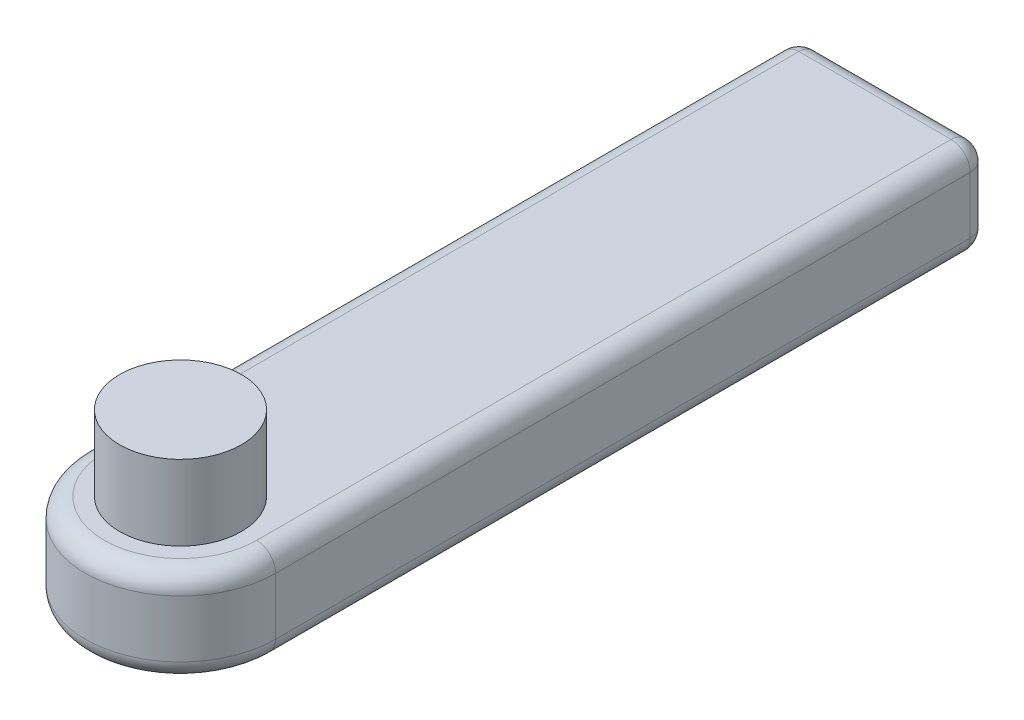
ISO-10303-21;
HEADER;
FILE_DESCRIPTION(('STEP AP214'),'2;1');
FILE_NAME('part.step','',(''),(''),'','','');
FILE_SCHEMA(('AUTOMOTIVE_DESIGN { 1 0 10303 214 1 1 1 1 }'));
ENDSEC;
DATA;
#1=APPLICATION_CONTEXT('core data for automotive mechanical design processes');
#2=APPLICATION_PROTOCOL_DEFINITION('international standard','automotive_design',2000,#1);
#3=PRODUCT_CONTEXT('',#1,'mechanical');
#4=PRODUCT('Part','Part','',(#3));
#5=PRODUCT_RELATED_PRODUCT_CATEGORY('part','',(#4));
#6=PRODUCT_DEFINITION_FORMATION('','',#4);
#7=PRODUCT_DEFINITION_CONTEXT('part definition',#1,'design');
#8=PRODUCT_DEFINITION('design','',#6,#7);
#9=PRODUCT_DEFINITION_SHAPE('','',#8);
#10=(LENGTH_UNIT() NAMED_UNIT(*) SI_UNIT(.MILLI.,.METRE.));
#11=(NAMED_UNIT(*) PLANE_ANGLE_UNIT() SI_UNIT($,.RADIAN.));
#12=(NAMED_UNIT(*) SI_UNIT($,.STERADIAN.) SOLID_ANGLE_UNIT());
#13=UNCERTAINTY_MEASURE_WITH_UNIT(LENGTH_MEASURE(1.E-05),#10,'distance_accuracy_value','');
#14=(GEOMETRIC_REPRESENTATION_CONTEXT(3) GLOBAL_UNCERTAINTY_ASSIGNED_CONTEXT((#13)) GLOBAL_UNIT_ASSIGNED_CONTEXT((#10,
#11,#12)) REPRESENTATION_CONTEXT('',''));
#15=CARTESIAN_POINT('',(0.,0.,0.));
#16=DIRECTION('',(0.,0.,1.));
#17=DIRECTION('',(1.,0.,0.));
#18=AXIS2_PLACEMENT_3D('',#15,#16,#17);
#19=CARTESIAN_POINT('',(0.,10.,0.));
#20=DIRECTION('',(0.,-1.,0.));
#21=DIRECTION('',(0.,0.,-1.));
#22=AXIS2_PLACEMENT_3D('',#19,#20,#21);
#23=CYLINDRICAL_SURFACE('',#22,10.);
#24=DIRECTION('',(0.,-1.,0.));
#25=VECTOR('',#24,1.);
#26=CARTESIAN_POINT('',(10.,10.,0.));
#27=LINE('',#26,#25);
#28=CARTESIAN_POINT('',(10.,8.,0.));
#29=VERTEX_POINT('',#28);
#30=CARTESIAN_POINT('',(10.,2.,0.));
#31=VERTEX_POINT('',#30);
#32=EDGE_CURVE('E146',#29,#31,#27,.T.);
#33=ORIENTED_EDGE('',*,*,#32,.F.);
#34=CARTESIAN_POINT('',(0.,8.,0.));
#35=DIRECTION('',(0.,1.,0.));
#36=DIRECTION('',(0.,0.,1.));
#37=AXIS2_PLACEMENT_3D('',#34,#35,#36);
#38=CIRCLE('',#37,10.);
#39=CARTESIAN_POINT('',(-10.,8.,0.));
#40=VERTEX_POINT('',#39);
#41=EDGE_CURVE('E178',#29,#40,#38,.F.);
#42=ORIENTED_EDGE('',*,*,#41,.T.);
#43=DIRECTION('',(0.,-1.,0.));
#44=VECTOR('',#43,1.);
#45=CARTESIAN_POINT('',(-10.,10.,0.));
#46=LINE('',#45,#44);
#47=CARTESIAN_POINT('',(-10.,2.,0.));
#48=VERTEX_POINT('',#47);
#49=EDGE_CURVE('E237',#40,#48,#46,.T.);
#50=ORIENTED_EDGE('',*,*,#49,.T.);
#51=CARTESIAN_POINT('',(0.,2.,0.));
#52=DIRECTION('',(0.,1.,0.));
#53=DIRECTION('',(0.,0.,1.));
#54=AXIS2_PLACEMENT_3D('',#51,#52,#53);
#55=CIRCLE('',#54,10.);
#56=EDGE_CURVE('E176',#48,#31,#55,.T.);
#57=ORIENTED_EDGE('',*,*,#56,.T.);
#58=EDGE_LOOP('',(#33,#42,#50,#57));
#59=FACE_BOUND('',#58,.T.);
#60=ADVANCED_FACE('F44',(#59),#23,.T.);
#61=CARTESIAN_POINT('',(10.,10.,0.));
#62=DIRECTION('',(-1.,0.,0.));
#63=DIRECTION('',(0.,0.,1.));
#64=AXIS2_PLACEMENT_3D('',#61,#62,#63);
#65=PLANE('',#64);
#66=ORIENTED_EDGE('',*,*,#32,.T.);
#67=DIRECTION('',(0.,0.,-1.));
#68=VECTOR('',#67,1.);
#69=CARTESIAN_POINT('',(10.,2.,0.));
#70=LINE('',#69,#68);
#71=CARTESIAN_POINT('',(10.,2.,-73.));
#72=VERTEX_POINT('',#71);
#73=EDGE_CURVE('E165',#31,#72,#70,.T.);
#74=ORIENTED_EDGE('',*,*,#73,.T.);
#75=DIRECTION('',(0.,-1.,0.));
#76=VECTOR('',#75,1.);
#77=CARTESIAN_POINT('',(10.,10.,-73.));
#78=LINE('',#77,#76);
#79=CARTESIAN_POINT('',(10.,8.,-73.));
#80=VERTEX_POINT('',#79);
#81=EDGE_CURVE('E161',#72,#80,#78,.F.);
#82=ORIENTED_EDGE('',*,*,#81,.T.);
#83=DIRECTION('',(0.,0.,-1.));
#84=VECTOR('',#83,1.);
#85=CARTESIAN_POINT('',(10.,8.,0.));
#86=LINE('',#85,#84);
#87=EDGE_CURVE('E163',#80,#29,#86,.F.);
#88=ORIENTED_EDGE('',*,*,#87,.T.);
#89=EDGE_LOOP('',(#66,#74,#82,#88));
#90=FACE_BOUND('',#89,.T.);
#91=ADVANCED_FACE('F246',(#90),#65,.F.);
#92=CARTESIAN_POINT('',(0.,10.,-75.));
#93=DIRECTION('',(0.,0.,-1.));
#94=DIRECTION('',(-1.,0.,0.));
#95=AXIS2_PLACEMENT_3D('',#92,#93,#94);
#96=PLANE('',#95);
#97=DIRECTION('',(1.,0.,0.));
#98=VECTOR('',#97,1.);
#99=CARTESIAN_POINT('',(0.,8.,-75.));
#100=LINE('',#99,#98);
#101=CARTESIAN_POINT('',(-8.,8.,-75.));
#102=VERTEX_POINT('',#101);
#103=CARTESIAN_POINT('',(8.,8.,-75.));
#104=VERTEX_POINT('',#103);
#105=EDGE_CURVE('E180',#102,#104,#100,.T.);
#106=ORIENTED_EDGE('',*,*,#105,.T.);
#107=DIRECTION('',(0.,-1.,0.));
#108=VECTOR('',#107,1.);
#109=CARTESIAN_POINT('',(8.,0.,-75.));
#110=LINE('',#109,#108);
#111=CARTESIAN_POINT('',(8.,2.,-75.));
#112=VERTEX_POINT('',#111);
#113=EDGE_CURVE('E11',#104,#112,#110,.T.);
#114=ORIENTED_EDGE('',*,*,#113,.T.);
#115=DIRECTION('',(1.,0.,0.));
#116=VECTOR('',#115,1.);
#117=CARTESIAN_POINT('',(-10.,2.,-75.));
#118=LINE('',#117,#116);
#119=CARTESIAN_POINT('',(-8.,2.,-75.));
#120=VERTEX_POINT('',#119);
#121=EDGE_CURVE('E53',#112,#120,#118,.F.);
#122=ORIENTED_EDGE('',*,*,#121,.T.);
#123=DIRECTION('',(0.,-1.,0.));
#124=VECTOR('',#123,1.);
#125=CARTESIAN_POINT('',(-8.,10.,-75.));
#126=LINE('',#125,#124);
#127=EDGE_CURVE('E182',#120,#102,#126,.F.);
#128=ORIENTED_EDGE('',*,*,#127,.T.);
#129=EDGE_LOOP('',(#106,#114,#122,#128));
#130=FACE_BOUND('',#129,.T.);
#131=CARTESIAN_POINT('',(0.,5.,-75.));
#132=DIRECTION('',(0.,0.,-1.));
#133=DIRECTION('',(-1.,0.,0.));
#134=AXIS2_PLACEMENT_3D('',#131,#132,#133);
#135=CIRCLE('',#134,2.75);
#136=CARTESIAN_POINT('',(-2.75,5.,-75.));
#137=VERTEX_POINT('',#136);
#138=EDGE_CURVE('E220',#137,#137,#135,.T.);
#139=ORIENTED_EDGE('',*,*,#138,.F.);
#140=EDGE_LOOP('',(#139));
#141=FACE_BOUND('',#140,.T.);
#142=ADVANCED_FACE('F275',(#130,#141),#96,.T.);
#143=CARTESIAN_POINT('',(-10.,10.,0.));
#144=DIRECTION('',(-1.,0.,0.));
#145=DIRECTION('',(0.,0.,1.));
#146=AXIS2_PLACEMENT_3D('',#143,#144,#145);
#147=PLANE('',#146);
#148=DIRECTION('',(0.,-1.,0.));
#149=VECTOR('',#148,1.);
#150=CARTESIAN_POINT('',(-10.,10.,-73.));
#151=LINE('',#150,#149);
#152=CARTESIAN_POINT('',(-10.,8.,-73.));
#153=VERTEX_POINT('',#152);
#154=CARTESIAN_POINT('',(-10.,2.,-73.));
#155=VERTEX_POINT('',#154);
#156=EDGE_CURVE('E158',#153,#155,#151,.T.);
#157=ORIENTED_EDGE('',*,*,#156,.T.);
#158=DIRECTION('',(0.,0.,-1.));
#159=VECTOR('',#158,1.);
#160=CARTESIAN_POINT('',(-10.,2.,0.));
#161=LINE('',#160,#159);
#162=EDGE_CURVE('E128',#155,#48,#161,.F.);
#163=ORIENTED_EDGE('',*,*,#162,.T.);
#164=ORIENTED_EDGE('',*,*,#49,.F.);
#165=DIRECTION('',(0.,0.,-1.));
#166=VECTOR('',#165,1.);
#167=CARTESIAN_POINT('',(-10.,8.,0.));
#168=LINE('',#167,#166);
#169=EDGE_CURVE('E153',#40,#153,#168,.T.);
#170=ORIENTED_EDGE('',*,*,#169,.T.);
#171=EDGE_LOOP('',(#157,#163,#164,#170));
#172=FACE_BOUND('',#171,.T.);
#173=ADVANCED_FACE('F259',(#172),#147,.T.);
#174=CARTESIAN_POINT('',(0.,10.,0.));
#175=DIRECTION('',(0.,1.,0.));
#176=DIRECTION('',(0.,0.,1.));
#177=AXIS2_PLACEMENT_3D('',#174,#175,#176);
#178=PLANE('',#177);
#179=CARTESIAN_POINT('',(0.,10.,0.));
#180=DIRECTION('',(0.,1.,0.));
#181=DIRECTION('',(0.,0.,1.));
#182=AXIS2_PLACEMENT_3D('',#179,#180,#181);
#183=CIRCLE('',#182,8.);
#184=CARTESIAN_POINT('',(-8.,10.,0.));
#185=VERTEX_POINT('',#184);
#186=CARTESIAN_POINT('',(8.,10.,0.));
#187=VERTEX_POINT('',#186);
#188=EDGE_CURVE('E171',#185,#187,#183,.T.);
#189=ORIENTED_EDGE('',*,*,#188,.T.);
#190=DIRECTION('',(0.,0.,-1.));
#191=VECTOR('',#190,1.);
#192=CARTESIAN_POINT('',(8.,10.,-75.));
#193=LINE('',#192,#191);
#194=CARTESIAN_POINT('',(8.,10.,-73.));
#195=VERTEX_POINT('',#194);
#196=EDGE_CURVE('E173',#187,#195,#193,.T.);
#197=ORIENTED_EDGE('',*,*,#196,.T.);
#198=DIRECTION('',(1.,0.,0.));
#199=VECTOR('',#198,1.);
#200=CARTESIAN_POINT('',(0.,10.,-73.));
#201=LINE('',#200,#199);
#202=CARTESIAN_POINT('',(-8.,10.,-73.));
#203=VERTEX_POINT('',#202);
#204=EDGE_CURVE('E169',#195,#203,#201,.F.);
#205=ORIENTED_EDGE('',*,*,#204,.T.);
#206=DIRECTION('',(0.,0.,-1.));
#207=VECTOR('',#206,1.);
#208=CARTESIAN_POINT('',(-8.,10.,0.));
#209=LINE('',#208,#207);
#210=EDGE_CURVE('E167',#203,#185,#209,.F.);
#211=ORIENTED_EDGE('',*,*,#210,.T.);
#212=EDGE_LOOP('',(#189,#197,#205,#211));
#213=FACE_BOUND('',#212,.T.);
#214=CARTESIAN_POINT('',(0.,10.,0.));
#215=DIRECTION('',(0.,1.,0.));
#216=DIRECTION('',(0.,0.,1.));
#217=AXIS2_PLACEMENT_3D('',#214,#215,#216);
#218=CIRCLE('',#217,6.4);
#219=CARTESIAN_POINT('',(0.,10.,6.4));
#220=VERTEX_POINT('',#219);
#221=EDGE_CURVE('E231',#220,#220,#218,.T.);
#222=ORIENTED_EDGE('',*,*,#221,.F.);
#223=EDGE_LOOP('',(#222));
#224=FACE_BOUND('',#223,.T.);
#225=ADVANCED_FACE('F440',(#213,#224),#178,.T.);
#226=CARTESIAN_POINT('',(0.,0.,0.));
#227=DIRECTION('',(0.,1.,0.));
#228=DIRECTION('',(0.,0.,1.));
#229=AXIS2_PLACEMENT_3D('',#226,#227,#228);
#230=PLANE('',#229);
#231=DIRECTION('',(0.,0.,-1.));
#232=VECTOR('',#231,1.);
#233=CARTESIAN_POINT('',(8.,0.,0.));
#234=LINE('',#233,#232);
#235=CARTESIAN_POINT('',(8.,0.,-73.));
#236=VERTEX_POINT('',#235);
#237=CARTESIAN_POINT('',(8.,0.,0.));
#238=VERTEX_POINT('',#237);
#239=EDGE_CURVE('E145',#236,#238,#234,.F.);
#240=ORIENTED_EDGE('',*,*,#239,.T.);
#241=CARTESIAN_POINT('',(0.,0.,0.));
#242=DIRECTION('',(0.,1.,0.));
#243=DIRECTION('',(0.,0.,1.));
#244=AXIS2_PLACEMENT_3D('',#241,#242,#243);
#245=CIRCLE('',#244,8.);
#246=CARTESIAN_POINT('',(-8.,0.,0.));
#247=VERTEX_POINT('',#246);
#248=EDGE_CURVE('E150',#238,#247,#245,.F.);
#249=ORIENTED_EDGE('',*,*,#248,.T.);
#250=DIRECTION('',(0.,0.,-1.));
#251=VECTOR('',#250,1.);
#252=CARTESIAN_POINT('',(-8.,0.,-75.));
#253=LINE('',#252,#251);
#254=CARTESIAN_POINT('',(-8.,0.,-73.));
#255=VERTEX_POINT('',#254);
#256=EDGE_CURVE('E126',#247,#255,#253,.T.);
#257=ORIENTED_EDGE('',*,*,#256,.T.);
#258=DIRECTION('',(1.,0.,0.));
#259=VECTOR('',#258,1.);
#260=CARTESIAN_POINT('',(10.,0.,-73.));
#261=LINE('',#260,#259);
#262=EDGE_CURVE('E140',#255,#236,#261,.T.);
#263=ORIENTED_EDGE('',*,*,#262,.T.);
#264=EDGE_LOOP('',(#240,#249,#257,#263));
#265=FACE_BOUND('',#264,.T.);
#266=ADVANCED_FACE('F148',(#265),#230,.F.);
#267=CARTESIAN_POINT('',(0.,17.9,0.));
#268=DIRECTION('',(0.,-1.,0.));
#269=DIRECTION('',(0.,0.,-1.));
#270=AXIS2_PLACEMENT_3D('',#267,#268,#269);
#271=CYLINDRICAL_SURFACE('',#270,6.4);
#272=CARTESIAN_POINT('',(0.,17.9,0.));
#273=DIRECTION('',(0.,1.,0.));
#274=DIRECTION('',(0.,0.,1.));
#275=AXIS2_PLACEMENT_3D('',#272,#273,#274);
#276=CIRCLE('',#275,6.4);
#277=CARTESIAN_POINT('',(0.,17.9,6.4));
#278=VERTEX_POINT('',#277);
#279=EDGE_CURVE('E234',#278,#278,#276,.T.);
#280=ORIENTED_EDGE('',*,*,#279,.F.);
#281=EDGE_LOOP('',(#280));
#282=FACE_BOUND('',#281,.T.);
#283=ORIENTED_EDGE('',*,*,#221,.T.);
#284=EDGE_LOOP('',(#283));
#285=FACE_BOUND('',#284,.T.);
#286=ADVANCED_FACE('F422',(#282,#285),#271,.T.);
#287=CARTESIAN_POINT('',(0.,17.9,0.));
#288=DIRECTION('',(0.,1.,0.));
#289=DIRECTION('',(0.,0.,1.));
#290=AXIS2_PLACEMENT_3D('',#287,#288,#289);
#291=PLANE('',#290);
#292=ORIENTED_EDGE('',*,*,#279,.T.);
#293=EDGE_LOOP('',(#292));
#294=FACE_BOUND('',#293,.T.);
#295=ADVANCED_FACE('F413',(#294),#291,.T.);
#296=CARTESIAN_POINT('',(0.,5.,-70.));
#297=DIRECTION('',(0.,0.,-1.));
#298=DIRECTION('',(-1.,0.,0.));
#299=AXIS2_PLACEMENT_3D('',#296,#297,#298);
#300=CYLINDRICAL_SURFACE('',#299,2.75);
#301=CARTESIAN_POINT('',(0.,5.,-70.));
#302=DIRECTION('',(0.,0.,-1.));
#303=DIRECTION('',(-1.,0.,0.));
#304=AXIS2_PLACEMENT_3D('',#301,#302,#303);
#305=CIRCLE('',#304,2.75);
#306=CARTESIAN_POINT('',(-2.75,5.,-70.));
#307=VERTEX_POINT('',#306);
#308=EDGE_CURVE('E226',#307,#307,#305,.T.);
#309=ORIENTED_EDGE('',*,*,#308,.F.);
#310=EDGE_LOOP('',(#309));
#311=FACE_BOUND('',#310,.T.);
#312=ORIENTED_EDGE('',*,*,#138,.T.);
#313=EDGE_LOOP('',(#312));
#314=FACE_BOUND('',#313,.T.);
#315=ADVANCED_FACE('F404',(#311,#314),#300,.F.);
#316=CARTESIAN_POINT('',(0.,5.,-70.));
#317=DIRECTION('',(0.,0.,-1.));
#318=DIRECTION('',(-1.,0.,0.));
#319=AXIS2_PLACEMENT_3D('',#316,#317,#318);
#320=PLANE('',#319);
#321=ORIENTED_EDGE('',*,*,#308,.T.);
#322=EDGE_LOOP('',(#321));
#323=FACE_BOUND('',#322,.T.);
#324=ADVANCED_FACE('F397',(#323),#320,.T.);
#325=CARTESIAN_POINT('',(8.,8.,0.));
#326=DIRECTION('',(0.,0.,1.));
#327=DIRECTION('',(1.,0.,0.));
#328=AXIS2_PLACEMENT_3D('',#325,#326,#327);
#329=CYLINDRICAL_SURFACE('',#328,2.);
#330=CARTESIAN_POINT('',(8.,8.,-73.));
#331=DIRECTION('',(0.,0.,-1.));
#332=DIRECTION('',(-1.,0.,0.));
#333=AXIS2_PLACEMENT_3D('',#330,#331,#332);
#334=CIRCLE('',#333,2.);
#335=EDGE_CURVE('E48',#195,#80,#334,.T.);
#336=ORIENTED_EDGE('',*,*,#335,.F.);
#337=ORIENTED_EDGE('',*,*,#196,.F.);
#338=CARTESIAN_POINT('',(8.,8.,0.));
#339=DIRECTION('',(0.,0.,1.));
#340=DIRECTION('',(1.,0.,0.));
#341=AXIS2_PLACEMENT_3D('',#338,#339,#340);
#342=CIRCLE('',#341,2.);
#343=EDGE_CURVE('E213',#29,#187,#342,.T.);
#344=ORIENTED_EDGE('',*,*,#343,.F.);
#345=ORIENTED_EDGE('',*,*,#87,.F.);
#346=EDGE_LOOP('',(#336,#337,#344,#345));
#347=FACE_BOUND('',#346,.T.);
#348=ADVANCED_FACE('F46',(#347),#329,.T.);
#349=CARTESIAN_POINT('',(8.,8.,-73.));
#350=DIRECTION('',(1.,0.,0.));
#351=DIRECTION('',(0.,0.,-1.));
#352=AXIS2_PLACEMENT_3D('',#349,#350,#351);
#353=SPHERICAL_SURFACE('',#352,2.);
#354=CARTESIAN_POINT('',(8.,8.,-73.));
#355=DIRECTION('',(1.,0.,0.));
#356=DIRECTION('',(0.,0.,-1.));
#357=AXIS2_PLACEMENT_3D('',#354,#355,#356);
#358=CIRCLE('',#357,2.);
#359=EDGE_CURVE('E208',#195,#104,#358,.F.);
#360=ORIENTED_EDGE('',*,*,#359,.F.);
#361=ORIENTED_EDGE('',*,*,#335,.T.);
#362=CARTESIAN_POINT('',(8.,8.,-73.));
#363=DIRECTION('',(0.,1.,0.));
#364=DIRECTION('',(0.,0.,1.));
#365=AXIS2_PLACEMENT_3D('',#362,#363,#364);
#366=CIRCLE('',#365,2.);
#367=EDGE_CURVE('E211',#104,#80,#366,.F.);
#368=ORIENTED_EDGE('',*,*,#367,.F.);
#369=EDGE_LOOP('',(#360,#361,#368));
#370=FACE_BOUND('',#369,.T.);
#371=ADVANCED_FACE('F280',(#370),#353,.T.);
#372=CARTESIAN_POINT('',(0.,8.,0.));
#373=DIRECTION('',(0.,1.,0.));
#374=DIRECTION('',(0.,0.,1.));
#375=AXIS2_PLACEMENT_3D('',#372,#373,#374);
#376=TOROIDAL_SURFACE('',#375,8.,2.);
#377=ORIENTED_EDGE('',*,*,#343,.T.);
#378=ORIENTED_EDGE('',*,*,#188,.F.);
#379=CARTESIAN_POINT('',(-8.,8.,0.));
#380=DIRECTION('',(0.,0.,-1.));
#381=DIRECTION('',(-1.,0.,0.));
#382=AXIS2_PLACEMENT_3D('',#379,#380,#381);
#383=CIRCLE('',#382,2.);
#384=EDGE_CURVE('E205',#40,#185,#383,.T.);
#385=ORIENTED_EDGE('',*,*,#384,.F.);
#386=ORIENTED_EDGE('',*,*,#41,.F.);
#387=EDGE_LOOP('',(#377,#378,#385,#386));
#388=FACE_BOUND('',#387,.T.);
#389=ADVANCED_FACE('F262',(#388),#376,.T.);
#390=CARTESIAN_POINT('',(8.,10.,-73.));
#391=DIRECTION('',(0.,1.,0.));
#392=DIRECTION('',(0.,0.,1.));
#393=AXIS2_PLACEMENT_3D('',#390,#391,#392);
#394=CYLINDRICAL_SURFACE('',#393,2.);
#395=ORIENTED_EDGE('',*,*,#367,.T.);
#396=ORIENTED_EDGE('',*,*,#81,.F.);
#397=CARTESIAN_POINT('',(8.,2.,-73.));
#398=DIRECTION('',(0.,-1.,0.));
#399=DIRECTION('',(0.,0.,-1.));
#400=AXIS2_PLACEMENT_3D('',#397,#398,#399);
#401=CIRCLE('',#400,2.);
#402=EDGE_CURVE('E202',#112,#72,#401,.T.);
#403=ORIENTED_EDGE('',*,*,#402,.F.);
#404=ORIENTED_EDGE('',*,*,#113,.F.);
#405=EDGE_LOOP('',(#395,#396,#403,#404));
#406=FACE_BOUND('',#405,.T.);
#407=ADVANCED_FACE('F283',(#406),#394,.T.);
#408=CARTESIAN_POINT('',(0.,8.,-73.));
#409=DIRECTION('',(1.,0.,0.));
#410=DIRECTION('',(0.,0.,-1.));
#411=AXIS2_PLACEMENT_3D('',#408,#409,#410);
#412=CYLINDRICAL_SURFACE('',#411,2.);
#413=ORIENTED_EDGE('',*,*,#359,.T.);
#414=ORIENTED_EDGE('',*,*,#105,.F.);
#415=CARTESIAN_POINT('',(-8.,8.,-73.));
#416=DIRECTION('',(-1.,0.,0.));
#417=DIRECTION('',(0.,0.,1.));
#418=AXIS2_PLACEMENT_3D('',#415,#416,#417);
#419=CIRCLE('',#418,2.);
#420=EDGE_CURVE('E199',#203,#102,#419,.T.);
#421=ORIENTED_EDGE('',*,*,#420,.F.);
#422=ORIENTED_EDGE('',*,*,#204,.F.);
#423=EDGE_LOOP('',(#413,#414,#421,#422));
#424=FACE_BOUND('',#423,.T.);
#425=ADVANCED_FACE('F278',(#424),#412,.T.);
#426=CARTESIAN_POINT('',(-8.,8.,0.));
#427=DIRECTION('',(0.,0.,-1.));
#428=DIRECTION('',(-1.,0.,0.));
#429=AXIS2_PLACEMENT_3D('',#426,#427,#428);
#430=CYLINDRICAL_SURFACE('',#429,2.);
#431=ORIENTED_EDGE('',*,*,#384,.T.);
#432=ORIENTED_EDGE('',*,*,#210,.F.);
#433=CARTESIAN_POINT('',(-8.,8.,-73.));
#434=DIRECTION('',(0.,0.,-1.));
#435=DIRECTION('',(-1.,0.,0.));
#436=AXIS2_PLACEMENT_3D('',#433,#434,#435);
#437=CIRCLE('',#436,2.);
#438=EDGE_CURVE('E196',#153,#203,#437,.T.);
#439=ORIENTED_EDGE('',*,*,#438,.F.);
#440=ORIENTED_EDGE('',*,*,#169,.F.);
#441=EDGE_LOOP('',(#431,#432,#439,#440));
#442=FACE_BOUND('',#441,.T.);
#443=ADVANCED_FACE('F267',(#442),#430,.T.);
#444=CARTESIAN_POINT('',(8.,2.,-73.));
#445=DIRECTION('',(1.,0.,0.));
#446=DIRECTION('',(0.,0.,-1.));
#447=AXIS2_PLACEMENT_3D('',#444,#445,#446);
#448=SPHERICAL_SURFACE('',#447,2.);
#449=CARTESIAN_POINT('',(8.,2.,-73.));
#450=DIRECTION('',(1.,0.,0.));
#451=DIRECTION('',(0.,0.,-1.));
#452=AXIS2_PLACEMENT_3D('',#449,#450,#451);
#453=CIRCLE('',#452,2.);
#454=EDGE_CURVE('E142',#112,#236,#453,.F.);
#455=ORIENTED_EDGE('',*,*,#454,.F.);
#456=ORIENTED_EDGE('',*,*,#402,.T.);
#457=CARTESIAN_POINT('',(8.,2.,-73.));
#458=DIRECTION('',(0.,0.,-1.));
#459=DIRECTION('',(-1.,0.,0.));
#460=AXIS2_PLACEMENT_3D('',#457,#458,#459);
#461=CIRCLE('',#460,2.);
#462=EDGE_CURVE('E193',#236,#72,#461,.F.);
#463=ORIENTED_EDGE('',*,*,#462,.F.);
#464=EDGE_LOOP('',(#455,#456,#463));
#465=FACE_BOUND('',#464,.T.);
#466=ADVANCED_FACE('F285',(#465),#448,.T.);
#467=CARTESIAN_POINT('',(-8.,8.,-73.));
#468=DIRECTION('',(0.,1.,0.));
#469=DIRECTION('',(0.,0.,1.));
#470=AXIS2_PLACEMENT_3D('',#467,#468,#469);
#471=SPHERICAL_SURFACE('',#470,2.);
#472=ORIENTED_EDGE('',*,*,#438,.T.);
#473=ORIENTED_EDGE('',*,*,#420,.T.);
#474=CARTESIAN_POINT('',(-8.,8.,-73.));
#475=DIRECTION('',(0.,1.,0.));
#476=DIRECTION('',(0.,0.,1.));
#477=AXIS2_PLACEMENT_3D('',#474,#475,#476);
#478=CIRCLE('',#477,2.);
#479=EDGE_CURVE('E189',#153,#102,#478,.F.);
#480=ORIENTED_EDGE('',*,*,#479,.F.);
#481=EDGE_LOOP('',(#472,#473,#480));
#482=FACE_BOUND('',#481,.T.);
#483=ADVANCED_FACE('F271',(#482),#471,.T.);
#484=CARTESIAN_POINT('',(8.,2.,0.));
#485=DIRECTION('',(0.,0.,-1.));
#486=DIRECTION('',(-1.,0.,0.));
#487=AXIS2_PLACEMENT_3D('',#484,#485,#486);
#488=CYLINDRICAL_SURFACE('',#487,2.);
#489=ORIENTED_EDGE('',*,*,#462,.T.);
#490=ORIENTED_EDGE('',*,*,#73,.F.);
#491=CARTESIAN_POINT('',(8.,2.,0.));
#492=DIRECTION('',(0.,0.,1.));
#493=DIRECTION('',(1.,0.,0.));
#494=AXIS2_PLACEMENT_3D('',#491,#492,#493);
#495=CIRCLE('',#494,2.);
#496=EDGE_CURVE('E138',#238,#31,#495,.T.);
#497=ORIENTED_EDGE('',*,*,#496,.F.);
#498=ORIENTED_EDGE('',*,*,#239,.F.);
#499=EDGE_LOOP('',(#489,#490,#497,#498));
#500=FACE_BOUND('',#499,.T.);
#501=ADVANCED_FACE('F252',(#500),#488,.T.);
#502=CARTESIAN_POINT('',(0.,2.,-73.));
#503=DIRECTION('',(-1.,0.,0.));
#504=DIRECTION('',(0.,0.,1.));
#505=AXIS2_PLACEMENT_3D('',#502,#503,#504);
#506=CYLINDRICAL_SURFACE('',#505,2.);
#507=ORIENTED_EDGE('',*,*,#454,.T.);
#508=ORIENTED_EDGE('',*,*,#262,.F.);
#509=CARTESIAN_POINT('',(-8.,2.,-73.));
#510=DIRECTION('',(-1.,0.,0.));
#511=DIRECTION('',(0.,0.,1.));
#512=AXIS2_PLACEMENT_3D('',#509,#510,#511);
#513=CIRCLE('',#512,2.);
#514=EDGE_CURVE('E133',#120,#255,#513,.T.);
#515=ORIENTED_EDGE('',*,*,#514,.F.);
#516=ORIENTED_EDGE('',*,*,#121,.F.);
#517=EDGE_LOOP('',(#507,#508,#515,#516));
#518=FACE_BOUND('',#517,.T.);
#519=ADVANCED_FACE('F141',(#518),#506,.T.);
#520=CARTESIAN_POINT('',(-8.,10.,-73.));
#521=DIRECTION('',(0.,-1.,0.));
#522=DIRECTION('',(0.,0.,-1.));
#523=AXIS2_PLACEMENT_3D('',#520,#521,#522);
#524=CYLINDRICAL_SURFACE('',#523,2.);
#525=ORIENTED_EDGE('',*,*,#479,.T.);
#526=ORIENTED_EDGE('',*,*,#127,.F.);
#527=CARTESIAN_POINT('',(-8.,2.,-73.));
#528=DIRECTION('',(0.,-1.,0.));
#529=DIRECTION('',(0.,0.,-1.));
#530=AXIS2_PLACEMENT_3D('',#527,#528,#529);
#531=CIRCLE('',#530,2.);
#532=EDGE_CURVE('E137',#155,#120,#531,.T.);
#533=ORIENTED_EDGE('',*,*,#532,.F.);
#534=ORIENTED_EDGE('',*,*,#156,.F.);
#535=EDGE_LOOP('',(#525,#526,#533,#534));
#536=FACE_BOUND('',#535,.T.);
#537=ADVANCED_FACE('F273',(#536),#524,.T.);
#538=CARTESIAN_POINT('',(0.,2.,0.));
#539=DIRECTION('',(0.,1.,0.));
#540=DIRECTION('',(0.,0.,1.));
#541=AXIS2_PLACEMENT_3D('',#538,#539,#540);
#542=TOROIDAL_SURFACE('',#541,8.,2.);
#543=ORIENTED_EDGE('',*,*,#496,.T.);
#544=ORIENTED_EDGE('',*,*,#56,.F.);
#545=CARTESIAN_POINT('',(-8.,2.,0.));
#546=DIRECTION('',(0.,0.,-1.));
#547=DIRECTION('',(-1.,0.,0.));
#548=AXIS2_PLACEMENT_3D('',#545,#546,#547);
#549=CIRCLE('',#548,2.);
#550=EDGE_CURVE('E131',#247,#48,#549,.T.);
#551=ORIENTED_EDGE('',*,*,#550,.F.);
#552=ORIENTED_EDGE('',*,*,#248,.F.);
#553=EDGE_LOOP('',(#543,#544,#551,#552));
#554=FACE_BOUND('',#553,.T.);
#555=ADVANCED_FACE('F256',(#554),#542,.T.);
#556=CARTESIAN_POINT('',(-8.,2.,-73.));
#557=DIRECTION('',(0.,0.,-1.));
#558=DIRECTION('',(-1.,0.,0.));
#559=AXIS2_PLACEMENT_3D('',#556,#557,#558);
#560=SPHERICAL_SURFACE('',#559,2.);
#561=ORIENTED_EDGE('',*,*,#532,.T.);
#562=ORIENTED_EDGE('',*,*,#514,.T.);
#563=CARTESIAN_POINT('',(-8.,2.,-73.));
#564=DIRECTION('',(0.,0.,-1.));
#565=DIRECTION('',(-1.,0.,0.));
#566=AXIS2_PLACEMENT_3D('',#563,#564,#565);
#567=CIRCLE('',#566,2.);
#568=EDGE_CURVE('E122',#155,#255,#567,.F.);
#569=ORIENTED_EDGE('',*,*,#568,.F.);
#570=EDGE_LOOP('',(#561,#562,#569));
#571=FACE_BOUND('',#570,.T.);
#572=ADVANCED_FACE('F135',(#571),#560,.T.);
#573=CARTESIAN_POINT('',(-8.,2.,0.));
#574=DIRECTION('',(0.,0.,1.));
#575=DIRECTION('',(1.,0.,0.));
#576=AXIS2_PLACEMENT_3D('',#573,#574,#575);
#577=CYLINDRICAL_SURFACE('',#576,2.);
#578=ORIENTED_EDGE('',*,*,#550,.T.);
#579=ORIENTED_EDGE('',*,*,#162,.F.);
#580=ORIENTED_EDGE('',*,*,#568,.T.);
#581=ORIENTED_EDGE('',*,*,#256,.F.);
#582=EDGE_LOOP('',(#578,#579,#580,#581));
#583=FACE_BOUND('',#582,.T.);
#584=ADVANCED_FACE('F124',(#583),#577,.T.);
#585=CLOSED_SHELL('',(#60,#91,#142,#173,#225,#266,#286,#295,#315,#324,#348,#371,#389,#407,#425,
#443,#466,#483,#501,#519,#537,#555,#572,#584));
#586=MANIFOLD_SOLID_BREP('B2',#585);
#587=ADVANCED_BREP_SHAPE_REPRESENTATION('',(#18,#586),#14);
#588=SHAPE_DEFINITION_REPRESENTATION(#9,#587);
ENDSEC;
END-ISO-10303-21;
